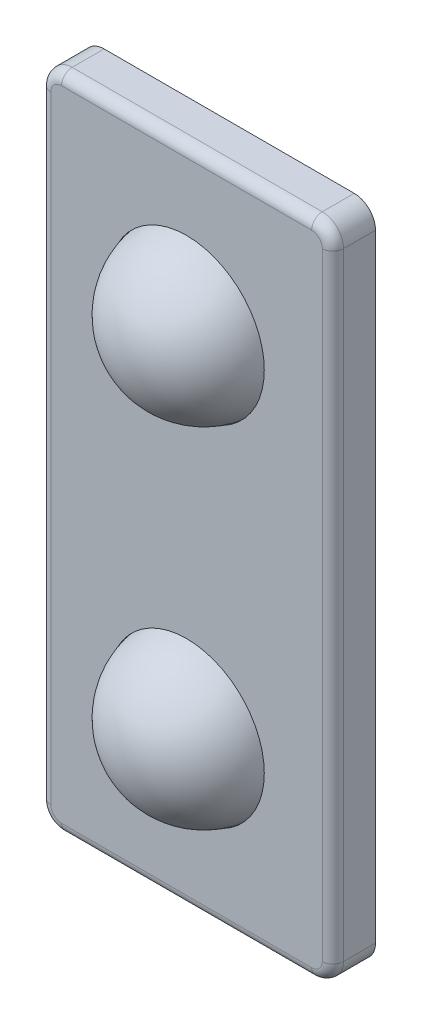
ISO-10303-21;
HEADER;
FILE_DESCRIPTION(('STEP AP214'),'2;1');
FILE_NAME('part.step','',(''),(''),'','','');
FILE_SCHEMA(('AUTOMOTIVE_DESIGN { 1 0 10303 214 1 1 1 1 }'));
ENDSEC;
DATA;
#1=APPLICATION_CONTEXT('core data for automotive mechanical design processes');
#2=APPLICATION_PROTOCOL_DEFINITION('international standard','automotive_design',2000,#1);
#3=PRODUCT_CONTEXT('',#1,'mechanical');
#4=PRODUCT('Part','Part','',(#3));
#5=PRODUCT_RELATED_PRODUCT_CATEGORY('part','',(#4));
#6=PRODUCT_DEFINITION_FORMATION('','',#4);
#7=PRODUCT_DEFINITION_CONTEXT('part definition',#1,'design');
#8=PRODUCT_DEFINITION('design','',#6,#7);
#9=PRODUCT_DEFINITION_SHAPE('','',#8);
#10=(LENGTH_UNIT() NAMED_UNIT(*) SI_UNIT(.MILLI.,.METRE.));
#11=(NAMED_UNIT(*) PLANE_ANGLE_UNIT() SI_UNIT($,.RADIAN.));
#12=(NAMED_UNIT(*) SI_UNIT($,.STERADIAN.) SOLID_ANGLE_UNIT());
#13=UNCERTAINTY_MEASURE_WITH_UNIT(LENGTH_MEASURE(1.E-05),#10,'distance_accuracy_value','');
#14=(GEOMETRIC_REPRESENTATION_CONTEXT(3) GLOBAL_UNCERTAINTY_ASSIGNED_CONTEXT((#13)) GLOBAL_UNIT_ASSIGNED_CONTEXT((#10,
#11,#12)) REPRESENTATION_CONTEXT('',''));
#15=CARTESIAN_POINT('',(0.,0.,0.));
#16=DIRECTION('',(0.,0.,1.));
#17=DIRECTION('',(1.,0.,0.));
#18=AXIS2_PLACEMENT_3D('',#15,#16,#17);
#19=CARTESIAN_POINT('',(5.125,13.75,0.5));
#20=DIRECTION('',(-1.,0.,0.));
#21=DIRECTION('',(0.,-1.,0.));
#22=AXIS2_PLACEMENT_3D('',#19,#20,#21);
#23=PLANE('',#22);
#24=DIRECTION('',(0.,1.,0.));
#25=VECTOR('',#24,1.);
#26=CARTESIAN_POINT('',(5.125,13.75,0.));
#27=LINE('',#26,#25);
#28=CARTESIAN_POINT('',(5.125,-13.75,0.));
#29=VERTEX_POINT('',#28);
#30=CARTESIAN_POINT('',(5.125,13.75,0.));
#31=VERTEX_POINT('',#30);
#32=EDGE_CURVE('E183',#29,#31,#27,.T.);
#33=ORIENTED_EDGE('',*,*,#32,.T.);
#34=DIRECTION('',(0.,0.,-1.));
#35=VECTOR('',#34,1.);
#36=CARTESIAN_POINT('',(5.125,13.75,0.5));
#37=LINE('',#36,#35);
#38=CARTESIAN_POINT('',(5.125,13.75,0.5));
#39=VERTEX_POINT('',#38);
#40=EDGE_CURVE('E159',#39,#31,#37,.T.);
#41=ORIENTED_EDGE('',*,*,#40,.F.);
#42=DIRECTION('',(0.,1.,0.));
#43=VECTOR('',#42,1.);
#44=CARTESIAN_POINT('',(5.125,13.75,0.5));
#45=LINE('',#44,#43);
#46=CARTESIAN_POINT('',(5.125,-13.75,0.5));
#47=VERTEX_POINT('',#46);
#48=EDGE_CURVE('E153',#47,#39,#45,.T.);
#49=ORIENTED_EDGE('',*,*,#48,.F.);
#50=DIRECTION('',(0.,0.,-1.));
#51=VECTOR('',#50,1.);
#52=CARTESIAN_POINT('',(5.125,-13.75,0.5));
#53=LINE('',#52,#51);
#54=EDGE_CURVE('E156',#47,#29,#53,.T.);
#55=ORIENTED_EDGE('',*,*,#54,.T.);
#56=EDGE_LOOP('',(#33,#41,#49,#55));
#57=FACE_BOUND('',#56,.T.);
#58=ADVANCED_FACE('F37',(#57),#23,.F.);
#59=CARTESIAN_POINT('',(-5.125,13.75,0.5));
#60=DIRECTION('',(0.,-1.,0.));
#61=DIRECTION('',(0.,0.,-1.));
#62=AXIS2_PLACEMENT_3D('',#59,#60,#61);
#63=PLANE('',#62);
#64=DIRECTION('',(-1.,0.,0.));
#65=VECTOR('',#64,1.);
#66=CARTESIAN_POINT('',(-5.125,13.75,0.));
#67=LINE('',#66,#65);
#68=CARTESIAN_POINT('',(-5.125,13.75,0.));
#69=VERTEX_POINT('',#68);
#70=EDGE_CURVE('E185',#31,#69,#67,.T.);
#71=ORIENTED_EDGE('',*,*,#70,.T.);
#72=DIRECTION('',(0.,0.,-1.));
#73=VECTOR('',#72,1.);
#74=CARTESIAN_POINT('',(-5.125,13.75,0.5));
#75=LINE('',#74,#73);
#76=CARTESIAN_POINT('',(-5.125,13.75,0.5));
#77=VERTEX_POINT('',#76);
#78=EDGE_CURVE('E192',#77,#69,#75,.T.);
#79=ORIENTED_EDGE('',*,*,#78,.F.);
#80=DIRECTION('',(-1.,0.,0.));
#81=VECTOR('',#80,1.);
#82=CARTESIAN_POINT('',(-5.125,13.75,0.5));
#83=LINE('',#82,#81);
#84=EDGE_CURVE('E163',#39,#77,#83,.T.);
#85=ORIENTED_EDGE('',*,*,#84,.F.);
#86=ORIENTED_EDGE('',*,*,#40,.T.);
#87=EDGE_LOOP('',(#71,#79,#85,#86));
#88=FACE_BOUND('',#87,.T.);
#89=ADVANCED_FACE('F297',(#88),#63,.F.);
#90=CARTESIAN_POINT('',(-5.125,13.75,0.5));
#91=DIRECTION('',(1.,0.,0.));
#92=DIRECTION('',(0.,1.,0.));
#93=AXIS2_PLACEMENT_3D('',#90,#91,#92);
#94=PLANE('',#93);
#95=DIRECTION('',(0.,-1.,0.));
#96=VECTOR('',#95,1.);
#97=CARTESIAN_POINT('',(-5.125,13.75,0.));
#98=LINE('',#97,#96);
#99=CARTESIAN_POINT('',(-5.125,-13.75,0.));
#100=VERTEX_POINT('',#99);
#101=EDGE_CURVE('E188',#69,#100,#98,.T.);
#102=ORIENTED_EDGE('',*,*,#101,.T.);
#103=DIRECTION('',(0.,0.,-1.));
#104=VECTOR('',#103,1.);
#105=CARTESIAN_POINT('',(-5.125,-13.75,0.5));
#106=LINE('',#105,#104);
#107=CARTESIAN_POINT('',(-5.125,-13.75,0.5));
#108=VERTEX_POINT('',#107);
#109=EDGE_CURVE('E173',#108,#100,#106,.T.);
#110=ORIENTED_EDGE('',*,*,#109,.F.);
#111=DIRECTION('',(0.,-1.,0.));
#112=VECTOR('',#111,1.);
#113=CARTESIAN_POINT('',(-5.125,13.75,0.5));
#114=LINE('',#113,#112);
#115=EDGE_CURVE('E178',#77,#108,#114,.T.);
#116=ORIENTED_EDGE('',*,*,#115,.F.);
#117=ORIENTED_EDGE('',*,*,#78,.T.);
#118=EDGE_LOOP('',(#102,#110,#116,#117));
#119=FACE_BOUND('',#118,.T.);
#120=ADVANCED_FACE('F300',(#119),#94,.F.);
#121=CARTESIAN_POINT('',(-5.125,-13.75,0.5));
#122=DIRECTION('',(0.,1.,0.));
#123=DIRECTION('',(0.,0.,1.));
#124=AXIS2_PLACEMENT_3D('',#121,#122,#123);
#125=PLANE('',#124);
#126=DIRECTION('',(1.,0.,0.));
#127=VECTOR('',#126,1.);
#128=CARTESIAN_POINT('',(-5.125,-13.75,0.));
#129=LINE('',#128,#127);
#130=EDGE_CURVE('E164',#100,#29,#129,.T.);
#131=ORIENTED_EDGE('',*,*,#130,.T.);
#132=ORIENTED_EDGE('',*,*,#54,.F.);
#133=DIRECTION('',(1.,0.,0.));
#134=VECTOR('',#133,1.);
#135=CARTESIAN_POINT('',(-5.125,-13.75,0.5));
#136=LINE('',#135,#134);
#137=EDGE_CURVE('E170',#108,#47,#136,.T.);
#138=ORIENTED_EDGE('',*,*,#137,.F.);
#139=ORIENTED_EDGE('',*,*,#109,.T.);
#140=EDGE_LOOP('',(#131,#132,#138,#139));
#141=FACE_BOUND('',#140,.T.);
#142=ADVANCED_FACE('F168',(#141),#125,.F.);
#143=CARTESIAN_POINT('',(0.,0.,0.));
#144=DIRECTION('',(0.,0.,1.));
#145=DIRECTION('',(1.,0.,0.));
#146=AXIS2_PLACEMENT_3D('',#143,#144,#145);
#147=PLANE('',#146);
#148=ORIENTED_EDGE('',*,*,#32,.F.);
#149=ORIENTED_EDGE('',*,*,#130,.F.);
#150=ORIENTED_EDGE('',*,*,#101,.F.);
#151=ORIENTED_EDGE('',*,*,#70,.F.);
#152=EDGE_LOOP('',(#148,#149,#150,#151));
#153=FACE_BOUND('',#152,.T.);
#154=ADVANCED_FACE('F302',(#153),#147,.F.);
#155=CARTESIAN_POINT('',(6.875,-15.5,2.5));
#156=DIRECTION('',(-1.,0.,0.));
#157=DIRECTION('',(0.,0.,1.));
#158=AXIS2_PLACEMENT_3D('',#155,#156,#157);
#159=PLANE('',#158);
#160=DIRECTION('',(0.,0.,-1.));
#161=VECTOR('',#160,1.);
#162=CARTESIAN_POINT('',(6.875,14.5,2.5));
#163=LINE('',#162,#161);
#164=CARTESIAN_POINT('',(6.875,14.5,0.5));
#165=VERTEX_POINT('',#164);
#166=CARTESIAN_POINT('',(6.875,14.5,2.));
#167=VERTEX_POINT('',#166);
#168=EDGE_CURVE('E210',#165,#167,#163,.F.);
#169=ORIENTED_EDGE('',*,*,#168,.T.);
#170=DIRECTION('',(0.,1.,0.));
#171=VECTOR('',#170,1.);
#172=CARTESIAN_POINT('',(6.875,-15.5,2.));
#173=LINE('',#172,#171);
#174=CARTESIAN_POINT('',(6.875,-14.5,2.));
#175=VERTEX_POINT('',#174);
#176=EDGE_CURVE('E11',#167,#175,#173,.F.);
#177=ORIENTED_EDGE('',*,*,#176,.T.);
#178=DIRECTION('',(0.,0.,-1.));
#179=VECTOR('',#178,1.);
#180=CARTESIAN_POINT('',(6.875,-14.5,2.5));
#181=LINE('',#180,#179);
#182=CARTESIAN_POINT('',(6.875,-14.5,0.5));
#183=VERTEX_POINT('',#182);
#184=EDGE_CURVE('E208',#175,#183,#181,.T.);
#185=ORIENTED_EDGE('',*,*,#184,.T.);
#186=DIRECTION('',(0.,1.,0.));
#187=VECTOR('',#186,1.);
#188=CARTESIAN_POINT('',(6.875,-15.5,0.5));
#189=LINE('',#188,#187);
#190=EDGE_CURVE('E274',#183,#165,#189,.T.);
#191=ORIENTED_EDGE('',*,*,#190,.T.);
#192=EDGE_LOOP('',(#169,#177,#185,#191));
#193=FACE_BOUND('',#192,.T.);
#194=ADVANCED_FACE('F304',(#193),#159,.F.);
#195=CARTESIAN_POINT('',(-6.875,15.5,2.5));
#196=DIRECTION('',(0.,-1.,0.));
#197=DIRECTION('',(0.,0.,-1.));
#198=AXIS2_PLACEMENT_3D('',#195,#196,#197);
#199=PLANE('',#198);
#200=DIRECTION('',(0.,0.,-1.));
#201=VECTOR('',#200,1.);
#202=CARTESIAN_POINT('',(-5.875,15.5,2.5));
#203=LINE('',#202,#201);
#204=CARTESIAN_POINT('',(-5.875,15.5,0.5));
#205=VERTEX_POINT('',#204);
#206=CARTESIAN_POINT('',(-5.875,15.5,2.));
#207=VERTEX_POINT('',#206);
#208=EDGE_CURVE('E196',#205,#207,#203,.F.);
#209=ORIENTED_EDGE('',*,*,#208,.T.);
#210=DIRECTION('',(-1.,0.,0.));
#211=VECTOR('',#210,1.);
#212=CARTESIAN_POINT('',(-6.875,15.5,2.));
#213=LINE('',#212,#211);
#214=CARTESIAN_POINT('',(5.875,15.5,2.));
#215=VERTEX_POINT('',#214);
#216=EDGE_CURVE('E61',#207,#215,#213,.F.);
#217=ORIENTED_EDGE('',*,*,#216,.T.);
#218=DIRECTION('',(0.,0.,-1.));
#219=VECTOR('',#218,1.);
#220=CARTESIAN_POINT('',(5.875,15.5,2.5));
#221=LINE('',#220,#219);
#222=CARTESIAN_POINT('',(5.875,15.5,0.5));
#223=VERTEX_POINT('',#222);
#224=EDGE_CURVE('E198',#215,#223,#221,.T.);
#225=ORIENTED_EDGE('',*,*,#224,.T.);
#226=DIRECTION('',(-1.,0.,0.));
#227=VECTOR('',#226,1.);
#228=CARTESIAN_POINT('',(-6.875,15.5,0.5));
#229=LINE('',#228,#227);
#230=EDGE_CURVE('E289',#223,#205,#229,.T.);
#231=ORIENTED_EDGE('',*,*,#230,.T.);
#232=EDGE_LOOP('',(#209,#217,#225,#231));
#233=FACE_BOUND('',#232,.T.);
#234=ADVANCED_FACE('F310',(#233),#199,.F.);
#235=CARTESIAN_POINT('',(-6.875,-15.5,2.5));
#236=DIRECTION('',(1.,0.,0.));
#237=DIRECTION('',(0.,0.,-1.));
#238=AXIS2_PLACEMENT_3D('',#235,#236,#237);
#239=PLANE('',#238);
#240=DIRECTION('',(0.,0.,-1.));
#241=VECTOR('',#240,1.);
#242=CARTESIAN_POINT('',(-6.875,-14.5,2.5));
#243=LINE('',#242,#241);
#244=CARTESIAN_POINT('',(-6.875,-14.5,0.5));
#245=VERTEX_POINT('',#244);
#246=CARTESIAN_POINT('',(-6.875,-14.5,2.));
#247=VERTEX_POINT('',#246);
#248=EDGE_CURVE('E219',#245,#247,#243,.F.);
#249=ORIENTED_EDGE('',*,*,#248,.T.);
#250=DIRECTION('',(0.,-1.,0.));
#251=VECTOR('',#250,1.);
#252=CARTESIAN_POINT('',(-6.875,-15.5,2.));
#253=LINE('',#252,#251);
#254=CARTESIAN_POINT('',(-6.875,14.5,2.));
#255=VERTEX_POINT('',#254);
#256=EDGE_CURVE('E246',#247,#255,#253,.F.);
#257=ORIENTED_EDGE('',*,*,#256,.T.);
#258=DIRECTION('',(0.,0.,-1.));
#259=VECTOR('',#258,1.);
#260=CARTESIAN_POINT('',(-6.875,14.5,2.5));
#261=LINE('',#260,#259);
#262=CARTESIAN_POINT('',(-6.875,14.5,0.5));
#263=VERTEX_POINT('',#262);
#264=EDGE_CURVE('E217',#255,#263,#261,.T.);
#265=ORIENTED_EDGE('',*,*,#264,.T.);
#266=DIRECTION('',(0.,-1.,0.));
#267=VECTOR('',#266,1.);
#268=CARTESIAN_POINT('',(-6.875,-15.5,0.5));
#269=LINE('',#268,#267);
#270=EDGE_CURVE('E292',#263,#245,#269,.T.);
#271=ORIENTED_EDGE('',*,*,#270,.T.);
#272=EDGE_LOOP('',(#249,#257,#265,#271));
#273=FACE_BOUND('',#272,.T.);
#274=ADVANCED_FACE('F394',(#273),#239,.F.);
#275=CARTESIAN_POINT('',(-6.875,-15.5,2.5));
#276=DIRECTION('',(0.,1.,0.));
#277=DIRECTION('',(0.,0.,1.));
#278=AXIS2_PLACEMENT_3D('',#275,#276,#277);
#279=PLANE('',#278);
#280=DIRECTION('',(0.,0.,-1.));
#281=VECTOR('',#280,1.);
#282=CARTESIAN_POINT('',(5.875,-15.5,2.5));
#283=LINE('',#282,#281);
#284=CARTESIAN_POINT('',(5.875,-15.5,0.5));
#285=VERTEX_POINT('',#284);
#286=CARTESIAN_POINT('',(5.875,-15.5,2.));
#287=VERTEX_POINT('',#286);
#288=EDGE_CURVE('E214',#285,#287,#283,.F.);
#289=ORIENTED_EDGE('',*,*,#288,.T.);
#290=DIRECTION('',(1.,0.,0.));
#291=VECTOR('',#290,1.);
#292=CARTESIAN_POINT('',(-6.875,-15.5,2.));
#293=LINE('',#292,#291);
#294=CARTESIAN_POINT('',(-5.875,-15.5,2.));
#295=VERTEX_POINT('',#294);
#296=EDGE_CURVE('E242',#287,#295,#293,.F.);
#297=ORIENTED_EDGE('',*,*,#296,.T.);
#298=DIRECTION('',(0.,0.,-1.));
#299=VECTOR('',#298,1.);
#300=CARTESIAN_POINT('',(-5.875,-15.5,2.5));
#301=LINE('',#300,#299);
#302=CARTESIAN_POINT('',(-5.875,-15.5,0.5));
#303=VERTEX_POINT('',#302);
#304=EDGE_CURVE('E212',#295,#303,#301,.T.);
#305=ORIENTED_EDGE('',*,*,#304,.T.);
#306=DIRECTION('',(1.,0.,0.));
#307=VECTOR('',#306,1.);
#308=CARTESIAN_POINT('',(-6.875,-15.5,0.5));
#309=LINE('',#308,#307);
#310=EDGE_CURVE('E186',#303,#285,#309,.T.);
#311=ORIENTED_EDGE('',*,*,#310,.T.);
#312=EDGE_LOOP('',(#289,#297,#305,#311));
#313=FACE_BOUND('',#312,.T.);
#314=ADVANCED_FACE('F388',(#313),#279,.F.);
#315=CARTESIAN_POINT('',(0.,0.,2.5));
#316=DIRECTION('',(0.,0.,-1.));
#317=DIRECTION('',(-1.,0.,0.));
#318=AXIS2_PLACEMENT_3D('',#315,#316,#317);
#319=PLANE('',#318);
#320=CARTESIAN_POINT('',(0.,-8.2,2.5));
#321=DIRECTION('',(0.,0.,-1.));
#322=DIRECTION('',(1.,0.,0.));
#323=AXIS2_PLACEMENT_3D('',#320,#321,#322);
#324=CIRCLE('',#323,3.65);
#325=CARTESIAN_POINT('',(3.65,-8.2,2.5));
#326=VERTEX_POINT('',#325);
#327=EDGE_CURVE('E284',#326,#326,#324,.T.);
#328=ORIENTED_EDGE('',*,*,#327,.T.);
#329=EDGE_LOOP('',(#328));
#330=FACE_BOUND('',#329,.T.);
#331=CARTESIAN_POINT('',(0.,8.2,2.5));
#332=DIRECTION('',(0.,0.,1.));
#333=DIRECTION('',(1.,0.,0.));
#334=AXIS2_PLACEMENT_3D('',#331,#332,#333);
#335=CIRCLE('',#334,3.65);
#336=CARTESIAN_POINT('',(3.65,8.2,2.5));
#337=VERTEX_POINT('',#336);
#338=EDGE_CURVE('E276',#337,#337,#335,.T.);
#339=ORIENTED_EDGE('',*,*,#338,.F.);
#340=EDGE_LOOP('',(#339));
#341=FACE_BOUND('',#340,.T.);
#342=DIRECTION('',(1.,0.,0.));
#343=VECTOR('',#342,1.);
#344=CARTESIAN_POINT('',(0.,-15.,2.5));
#345=LINE('',#344,#343);
#346=CARTESIAN_POINT('',(-5.875,-15.,2.5));
#347=VERTEX_POINT('',#346);
#348=CARTESIAN_POINT('',(5.875,-15.,2.5));
#349=VERTEX_POINT('',#348);
#350=EDGE_CURVE('E234',#347,#349,#345,.T.);
#351=ORIENTED_EDGE('',*,*,#350,.T.);
#352=CARTESIAN_POINT('',(5.875,-14.5,2.5));
#353=DIRECTION('',(0.,0.,-1.));
#354=DIRECTION('',(-1.,0.,0.));
#355=AXIS2_PLACEMENT_3D('',#352,#353,#354);
#356=CIRCLE('',#355,0.5);
#357=CARTESIAN_POINT('',(6.375,-14.5,2.5));
#358=VERTEX_POINT('',#357);
#359=EDGE_CURVE('E236',#349,#358,#356,.F.);
#360=ORIENTED_EDGE('',*,*,#359,.T.);
#361=DIRECTION('',(0.,1.,0.));
#362=VECTOR('',#361,1.);
#363=CARTESIAN_POINT('',(6.375,0.,2.5));
#364=LINE('',#363,#362);
#365=CARTESIAN_POINT('',(6.375,14.5,2.5));
#366=VERTEX_POINT('',#365);
#367=EDGE_CURVE('E222',#358,#366,#364,.T.);
#368=ORIENTED_EDGE('',*,*,#367,.T.);
#369=CARTESIAN_POINT('',(5.875,14.5,2.5));
#370=DIRECTION('',(0.,0.,-1.));
#371=DIRECTION('',(-1.,0.,0.));
#372=AXIS2_PLACEMENT_3D('',#369,#370,#371);
#373=CIRCLE('',#372,0.5);
#374=CARTESIAN_POINT('',(5.875,15.,2.5));
#375=VERTEX_POINT('',#374);
#376=EDGE_CURVE('E224',#366,#375,#373,.F.);
#377=ORIENTED_EDGE('',*,*,#376,.T.);
#378=DIRECTION('',(-1.,0.,0.));
#379=VECTOR('',#378,1.);
#380=CARTESIAN_POINT('',(0.,15.,2.5));
#381=LINE('',#380,#379);
#382=CARTESIAN_POINT('',(-5.875,15.,2.5));
#383=VERTEX_POINT('',#382);
#384=EDGE_CURVE('E226',#375,#383,#381,.T.);
#385=ORIENTED_EDGE('',*,*,#384,.T.);
#386=CARTESIAN_POINT('',(-5.875,14.5,2.5));
#387=DIRECTION('',(0.,0.,-1.));
#388=DIRECTION('',(-1.,0.,0.));
#389=AXIS2_PLACEMENT_3D('',#386,#387,#388);
#390=CIRCLE('',#389,0.5);
#391=CARTESIAN_POINT('',(-6.375,14.5,2.5));
#392=VERTEX_POINT('',#391);
#393=EDGE_CURVE('E228',#383,#392,#390,.F.);
#394=ORIENTED_EDGE('',*,*,#393,.T.);
#395=DIRECTION('',(0.,-1.,0.));
#396=VECTOR('',#395,1.);
#397=CARTESIAN_POINT('',(-6.375,0.,2.5));
#398=LINE('',#397,#396);
#399=CARTESIAN_POINT('',(-6.375,-14.5,2.5));
#400=VERTEX_POINT('',#399);
#401=EDGE_CURVE('E230',#392,#400,#398,.T.);
#402=ORIENTED_EDGE('',*,*,#401,.T.);
#403=CARTESIAN_POINT('',(-5.875,-14.5,2.5));
#404=DIRECTION('',(0.,0.,-1.));
#405=DIRECTION('',(-1.,0.,0.));
#406=AXIS2_PLACEMENT_3D('',#403,#404,#405);
#407=CIRCLE('',#406,0.5);
#408=EDGE_CURVE('E232',#400,#347,#407,.F.);
#409=ORIENTED_EDGE('',*,*,#408,.T.);
#410=EDGE_LOOP('',(#351,#360,#368,#377,#385,#394,#402,#409));
#411=FACE_BOUND('',#410,.T.);
#412=ADVANCED_FACE('F385',(#330,#341,#411),#319,.F.);
#413=CARTESIAN_POINT('',(0.,0.,0.5));
#414=DIRECTION('',(0.,0.,-1.));
#415=DIRECTION('',(-1.,0.,0.));
#416=AXIS2_PLACEMENT_3D('',#413,#414,#415);
#417=PLANE('',#416);
#418=ORIENTED_EDGE('',*,*,#137,.T.);
#419=ORIENTED_EDGE('',*,*,#48,.T.);
#420=ORIENTED_EDGE('',*,*,#84,.T.);
#421=ORIENTED_EDGE('',*,*,#115,.T.);
#422=EDGE_LOOP('',(#418,#419,#420,#421));
#423=FACE_BOUND('',#422,.T.);
#424=ORIENTED_EDGE('',*,*,#230,.F.);
#425=CARTESIAN_POINT('',(5.875,14.5,0.5));
#426=DIRECTION('',(0.,0.,-1.));
#427=DIRECTION('',(-1.,0.,0.));
#428=AXIS2_PLACEMENT_3D('',#425,#426,#427);
#429=CIRCLE('',#428,1.);
#430=EDGE_CURVE('E206',#223,#165,#429,.T.);
#431=ORIENTED_EDGE('',*,*,#430,.T.);
#432=ORIENTED_EDGE('',*,*,#190,.F.);
#433=CARTESIAN_POINT('',(5.875,-14.5,0.5));
#434=DIRECTION('',(0.,0.,-1.));
#435=DIRECTION('',(-1.,0.,0.));
#436=AXIS2_PLACEMENT_3D('',#433,#434,#435);
#437=CIRCLE('',#436,1.);
#438=EDGE_CURVE('E204',#183,#285,#437,.T.);
#439=ORIENTED_EDGE('',*,*,#438,.T.);
#440=ORIENTED_EDGE('',*,*,#310,.F.);
#441=CARTESIAN_POINT('',(-5.875,-14.5,0.5));
#442=DIRECTION('',(0.,0.,-1.));
#443=DIRECTION('',(-1.,0.,0.));
#444=AXIS2_PLACEMENT_3D('',#441,#442,#443);
#445=CIRCLE('',#444,1.);
#446=EDGE_CURVE('E202',#303,#245,#445,.T.);
#447=ORIENTED_EDGE('',*,*,#446,.T.);
#448=ORIENTED_EDGE('',*,*,#270,.F.);
#449=CARTESIAN_POINT('',(-5.875,14.5,0.5));
#450=DIRECTION('',(0.,0.,-1.));
#451=DIRECTION('',(-1.,0.,0.));
#452=AXIS2_PLACEMENT_3D('',#449,#450,#451);
#453=CIRCLE('',#452,1.);
#454=EDGE_CURVE('E200',#263,#205,#453,.T.);
#455=ORIENTED_EDGE('',*,*,#454,.T.);
#456=EDGE_LOOP('',(#424,#431,#432,#439,#440,#447,#448,#455));
#457=FACE_BOUND('',#456,.T.);
#458=ADVANCED_FACE('F175',(#423,#457),#417,.T.);
#459=CARTESIAN_POINT('',(5.875,14.5,2.5));
#460=DIRECTION('',(0.,0.,-1.));
#461=DIRECTION('',(-1.,0.,0.));
#462=AXIS2_PLACEMENT_3D('',#459,#460,#461);
#463=CYLINDRICAL_SURFACE('',#462,1.);
#464=ORIENTED_EDGE('',*,*,#224,.F.);
#465=CARTESIAN_POINT('',(5.875,14.5,2.));
#466=DIRECTION('',(0.,0.,-1.));
#467=DIRECTION('',(-1.,0.,0.));
#468=AXIS2_PLACEMENT_3D('',#465,#466,#467);
#469=CIRCLE('',#468,1.);
#470=EDGE_CURVE('E46',#215,#167,#469,.T.);
#471=ORIENTED_EDGE('',*,*,#470,.T.);
#472=ORIENTED_EDGE('',*,*,#168,.F.);
#473=ORIENTED_EDGE('',*,*,#430,.F.);
#474=EDGE_LOOP('',(#464,#471,#472,#473));
#475=FACE_BOUND('',#474,.T.);
#476=ADVANCED_FACE('F322',(#475),#463,.T.);
#477=CARTESIAN_POINT('',(5.875,-14.5,2.5));
#478=DIRECTION('',(0.,0.,-1.));
#479=DIRECTION('',(-1.,0.,0.));
#480=AXIS2_PLACEMENT_3D('',#477,#478,#479);
#481=CYLINDRICAL_SURFACE('',#480,1.);
#482=ORIENTED_EDGE('',*,*,#184,.F.);
#483=CARTESIAN_POINT('',(5.875,-14.5,2.));
#484=DIRECTION('',(0.,0.,-1.));
#485=DIRECTION('',(-1.,0.,0.));
#486=AXIS2_PLACEMENT_3D('',#483,#484,#485);
#487=CIRCLE('',#486,1.);
#488=EDGE_CURVE('E239',#175,#287,#487,.T.);
#489=ORIENTED_EDGE('',*,*,#488,.T.);
#490=ORIENTED_EDGE('',*,*,#288,.F.);
#491=ORIENTED_EDGE('',*,*,#438,.F.);
#492=EDGE_LOOP('',(#482,#489,#490,#491));
#493=FACE_BOUND('',#492,.T.);
#494=ADVANCED_FACE('F325',(#493),#481,.T.);
#495=CARTESIAN_POINT('',(-5.875,-14.5,2.5));
#496=DIRECTION('',(0.,0.,-1.));
#497=DIRECTION('',(-1.,0.,0.));
#498=AXIS2_PLACEMENT_3D('',#495,#496,#497);
#499=CYLINDRICAL_SURFACE('',#498,1.);
#500=ORIENTED_EDGE('',*,*,#304,.F.);
#501=CARTESIAN_POINT('',(-5.875,-14.5,2.));
#502=DIRECTION('',(0.,0.,-1.));
#503=DIRECTION('',(-1.,0.,0.));
#504=AXIS2_PLACEMENT_3D('',#501,#502,#503);
#505=CIRCLE('',#504,1.);
#506=EDGE_CURVE('E244',#295,#247,#505,.T.);
#507=ORIENTED_EDGE('',*,*,#506,.T.);
#508=ORIENTED_EDGE('',*,*,#248,.F.);
#509=ORIENTED_EDGE('',*,*,#446,.F.);
#510=EDGE_LOOP('',(#500,#507,#508,#509));
#511=FACE_BOUND('',#510,.T.);
#512=ADVANCED_FACE('F328',(#511),#499,.T.);
#513=CARTESIAN_POINT('',(-5.875,14.5,2.5));
#514=DIRECTION('',(0.,0.,-1.));
#515=DIRECTION('',(-1.,0.,0.));
#516=AXIS2_PLACEMENT_3D('',#513,#514,#515);
#517=CYLINDRICAL_SURFACE('',#516,1.);
#518=ORIENTED_EDGE('',*,*,#264,.F.);
#519=CARTESIAN_POINT('',(-5.875,14.5,2.));
#520=DIRECTION('',(0.,0.,-1.));
#521=DIRECTION('',(-1.,0.,0.));
#522=AXIS2_PLACEMENT_3D('',#519,#520,#521);
#523=CIRCLE('',#522,1.);
#524=EDGE_CURVE('E248',#255,#207,#523,.T.);
#525=ORIENTED_EDGE('',*,*,#524,.T.);
#526=ORIENTED_EDGE('',*,*,#208,.F.);
#527=ORIENTED_EDGE('',*,*,#454,.F.);
#528=EDGE_LOOP('',(#518,#525,#526,#527));
#529=FACE_BOUND('',#528,.T.);
#530=ADVANCED_FACE('F332',(#529),#517,.T.);
#531=CARTESIAN_POINT('',(-5.875,14.5,2.));
#532=DIRECTION('',(0.,0.,-1.));
#533=DIRECTION('',(-1.,0.,0.));
#534=AXIS2_PLACEMENT_3D('',#531,#532,#533);
#535=DEGENERATE_TOROIDAL_SURFACE('',#534,0.5,0.5,.T.);
#536=CARTESIAN_POINT('',(-5.875,15.,2.));
#537=DIRECTION('',(1.,0.,0.));
#538=DIRECTION('',(0.,0.,-1.));
#539=AXIS2_PLACEMENT_3D('',#536,#537,#538);
#540=CIRCLE('',#539,0.5);
#541=EDGE_CURVE('E269',#207,#383,#540,.T.);
#542=ORIENTED_EDGE('',*,*,#541,.F.);
#543=ORIENTED_EDGE('',*,*,#524,.F.);
#544=CARTESIAN_POINT('',(-6.375,14.5,2.));
#545=DIRECTION('',(0.,-1.,0.));
#546=DIRECTION('',(0.,0.,-1.));
#547=AXIS2_PLACEMENT_3D('',#544,#545,#546);
#548=CIRCLE('',#547,0.5);
#549=EDGE_CURVE('E272',#392,#255,#548,.T.);
#550=ORIENTED_EDGE('',*,*,#549,.F.);
#551=ORIENTED_EDGE('',*,*,#393,.F.);
#552=EDGE_LOOP('',(#542,#543,#550,#551));
#553=FACE_BOUND('',#552,.T.);
#554=ADVANCED_FACE('F336',(#553),#535,.T.);
#555=CARTESIAN_POINT('',(-6.375,0.,2.));
#556=DIRECTION('',(0.,-1.,0.));
#557=DIRECTION('',(0.,0.,-1.));
#558=AXIS2_PLACEMENT_3D('',#555,#556,#557);
#559=CYLINDRICAL_SURFACE('',#558,0.5);
#560=ORIENTED_EDGE('',*,*,#549,.T.);
#561=ORIENTED_EDGE('',*,*,#256,.F.);
#562=CARTESIAN_POINT('',(-6.375,-14.5,2.));
#563=DIRECTION('',(0.,-1.,0.));
#564=DIRECTION('',(0.,0.,-1.));
#565=AXIS2_PLACEMENT_3D('',#562,#563,#564);
#566=CIRCLE('',#565,0.5);
#567=EDGE_CURVE('E266',#400,#247,#566,.T.);
#568=ORIENTED_EDGE('',*,*,#567,.F.);
#569=ORIENTED_EDGE('',*,*,#401,.F.);
#570=EDGE_LOOP('',(#560,#561,#568,#569));
#571=FACE_BOUND('',#570,.T.);
#572=ADVANCED_FACE('F362',(#571),#559,.T.);
#573=CARTESIAN_POINT('',(0.,15.,2.));
#574=DIRECTION('',(-1.,0.,0.));
#575=DIRECTION('',(0.,0.,1.));
#576=AXIS2_PLACEMENT_3D('',#573,#574,#575);
#577=CYLINDRICAL_SURFACE('',#576,0.5);
#578=ORIENTED_EDGE('',*,*,#541,.T.);
#579=ORIENTED_EDGE('',*,*,#384,.F.);
#580=CARTESIAN_POINT('',(5.875,15.,2.));
#581=DIRECTION('',(1.,0.,0.));
#582=DIRECTION('',(0.,0.,-1.));
#583=AXIS2_PLACEMENT_3D('',#580,#581,#582);
#584=CIRCLE('',#583,0.5);
#585=EDGE_CURVE('E263',#215,#375,#584,.T.);
#586=ORIENTED_EDGE('',*,*,#585,.F.);
#587=ORIENTED_EDGE('',*,*,#216,.F.);
#588=EDGE_LOOP('',(#578,#579,#586,#587));
#589=FACE_BOUND('',#588,.T.);
#590=ADVANCED_FACE('F358',(#589),#577,.T.);
#591=CARTESIAN_POINT('',(-5.875,-14.5,2.));
#592=DIRECTION('',(0.,0.,-1.));
#593=DIRECTION('',(-1.,0.,0.));
#594=AXIS2_PLACEMENT_3D('',#591,#592,#593);
#595=DEGENERATE_TOROIDAL_SURFACE('',#594,0.5,0.5,.T.);
#596=ORIENTED_EDGE('',*,*,#567,.T.);
#597=ORIENTED_EDGE('',*,*,#506,.F.);
#598=CARTESIAN_POINT('',(-5.875,-15.,2.));
#599=DIRECTION('',(1.,0.,0.));
#600=DIRECTION('',(0.,0.,-1.));
#601=AXIS2_PLACEMENT_3D('',#598,#599,#600);
#602=CIRCLE('',#601,0.5);
#603=EDGE_CURVE('E260',#347,#295,#602,.T.);
#604=ORIENTED_EDGE('',*,*,#603,.F.);
#605=ORIENTED_EDGE('',*,*,#408,.F.);
#606=EDGE_LOOP('',(#596,#597,#604,#605));
#607=FACE_BOUND('',#606,.T.);
#608=ADVANCED_FACE('F354',(#607),#595,.T.);
#609=CARTESIAN_POINT('',(5.875,14.5,2.));
#610=DIRECTION('',(0.,0.,-1.));
#611=DIRECTION('',(-1.,0.,0.));
#612=AXIS2_PLACEMENT_3D('',#609,#610,#611);
#613=DEGENERATE_TOROIDAL_SURFACE('',#612,0.5,0.5,.T.);
#614=ORIENTED_EDGE('',*,*,#585,.T.);
#615=ORIENTED_EDGE('',*,*,#376,.F.);
#616=CARTESIAN_POINT('',(6.375,14.5,2.));
#617=DIRECTION('',(0.,-1.,0.));
#618=DIRECTION('',(0.,0.,-1.));
#619=AXIS2_PLACEMENT_3D('',#616,#617,#618);
#620=CIRCLE('',#619,0.5);
#621=EDGE_CURVE('E257',#167,#366,#620,.T.);
#622=ORIENTED_EDGE('',*,*,#621,.F.);
#623=ORIENTED_EDGE('',*,*,#470,.F.);
#624=EDGE_LOOP('',(#614,#615,#622,#623));
#625=FACE_BOUND('',#624,.T.);
#626=ADVANCED_FACE('F350',(#625),#613,.T.);
#627=CARTESIAN_POINT('',(0.,-15.,2.));
#628=DIRECTION('',(1.,0.,0.));
#629=DIRECTION('',(0.,0.,-1.));
#630=AXIS2_PLACEMENT_3D('',#627,#628,#629);
#631=CYLINDRICAL_SURFACE('',#630,0.5);
#632=ORIENTED_EDGE('',*,*,#603,.T.);
#633=ORIENTED_EDGE('',*,*,#296,.F.);
#634=CARTESIAN_POINT('',(5.875,-15.,2.));
#635=DIRECTION('',(1.,0.,0.));
#636=DIRECTION('',(0.,0.,-1.));
#637=AXIS2_PLACEMENT_3D('',#634,#635,#636);
#638=CIRCLE('',#637,0.5);
#639=EDGE_CURVE('E254',#349,#287,#638,.T.);
#640=ORIENTED_EDGE('',*,*,#639,.F.);
#641=ORIENTED_EDGE('',*,*,#350,.F.);
#642=EDGE_LOOP('',(#632,#633,#640,#641));
#643=FACE_BOUND('',#642,.T.);
#644=ADVANCED_FACE('F346',(#643),#631,.T.);
#645=CARTESIAN_POINT('',(6.375,0.,2.));
#646=DIRECTION('',(0.,1.,0.));
#647=DIRECTION('',(0.,0.,1.));
#648=AXIS2_PLACEMENT_3D('',#645,#646,#647);
#649=CYLINDRICAL_SURFACE('',#648,0.5);
#650=ORIENTED_EDGE('',*,*,#621,.T.);
#651=ORIENTED_EDGE('',*,*,#367,.F.);
#652=CARTESIAN_POINT('',(6.375,-14.5,2.));
#653=DIRECTION('',(0.,-1.,0.));
#654=DIRECTION('',(0.,0.,-1.));
#655=AXIS2_PLACEMENT_3D('',#652,#653,#654);
#656=CIRCLE('',#655,0.5);
#657=EDGE_CURVE('E252',#175,#358,#656,.T.);
#658=ORIENTED_EDGE('',*,*,#657,.F.);
#659=ORIENTED_EDGE('',*,*,#176,.F.);
#660=EDGE_LOOP('',(#650,#651,#658,#659));
#661=FACE_BOUND('',#660,.T.);
#662=ADVANCED_FACE('F342',(#661),#649,.T.);
#663=CARTESIAN_POINT('',(5.875,-14.5,2.));
#664=DIRECTION('',(0.,0.,-1.));
#665=DIRECTION('',(-1.,0.,0.));
#666=AXIS2_PLACEMENT_3D('',#663,#664,#665);
#667=DEGENERATE_TOROIDAL_SURFACE('',#666,0.5,0.5,.T.);
#668=ORIENTED_EDGE('',*,*,#639,.T.);
#669=ORIENTED_EDGE('',*,*,#488,.F.);
#670=ORIENTED_EDGE('',*,*,#657,.T.);
#671=ORIENTED_EDGE('',*,*,#359,.F.);
#672=EDGE_LOOP('',(#668,#669,#670,#671));
#673=FACE_BOUND('',#672,.T.);
#674=ADVANCED_FACE('F338',(#673),#667,.T.);
#675=CARTESIAN_POINT('',(0.,8.2,2.4));
#676=DIRECTION('',(0.,0.,1.));
#677=DIRECTION('',(1.,0.,0.));
#678=AXIS2_PLACEMENT_3D('',#675,#676,#677);
#679=CYLINDRICAL_SURFACE('',#678,3.65);
#680=CARTESIAN_POINT('',(0.,8.2,2.4));
#681=DIRECTION('',(0.,0.,1.));
#682=DIRECTION('',(1.,0.,0.));
#683=AXIS2_PLACEMENT_3D('',#680,#681,#682);
#684=CIRCLE('',#683,3.65);
#685=CARTESIAN_POINT('',(3.65,8.2,2.4));
#686=VERTEX_POINT('',#685);
#687=EDGE_CURVE('E255',#686,#686,#684,.T.);
#688=ORIENTED_EDGE('',*,*,#687,.F.);
#689=EDGE_LOOP('',(#688));
#690=FACE_BOUND('',#689,.T.);
#691=ORIENTED_EDGE('',*,*,#338,.T.);
#692=EDGE_LOOP('',(#691));
#693=FACE_BOUND('',#692,.T.);
#694=ADVANCED_FACE('F341',(#690,#693),#679,.F.);
#695=CARTESIAN_POINT('',(0.,8.2,1.67958333333333));
#696=DIRECTION('',(0.,0.,1.));
#697=DIRECTION('',(1.,0.,0.));
#698=AXIS2_PLACEMENT_3D('',#695,#696,#697);
#699=SPHERICAL_SURFACE('',#698,3.72041666666667);
#700=ORIENTED_EDGE('',*,*,#687,.T.);
#701=EDGE_LOOP('',(#700));
#702=FACE_BOUND('',#701,.T.);
#703=ADVANCED_FACE('F369',(#702),#699,.T.);
#704=CARTESIAN_POINT('',(0.,-8.2,2.4));
#705=DIRECTION('',(0.,0.,1.));
#706=DIRECTION('',(1.,0.,0.));
#707=AXIS2_PLACEMENT_3D('',#704,#705,#706);
#708=CYLINDRICAL_SURFACE('',#707,3.65);
#709=CARTESIAN_POINT('',(0.,-8.2,2.4));
#710=DIRECTION('',(0.,0.,-1.));
#711=DIRECTION('',(1.,0.,0.));
#712=AXIS2_PLACEMENT_3D('',#709,#710,#711);
#713=CIRCLE('',#712,3.65);
#714=CARTESIAN_POINT('',(3.65,-8.2,2.4));
#715=VERTEX_POINT('',#714);
#716=EDGE_CURVE('E41',#715,#715,#713,.T.);
#717=ORIENTED_EDGE('',*,*,#716,.T.);
#718=EDGE_LOOP('',(#717));
#719=FACE_BOUND('',#718,.T.);
#720=ORIENTED_EDGE('',*,*,#327,.F.);
#721=EDGE_LOOP('',(#720));
#722=FACE_BOUND('',#721,.T.);
#723=ADVANCED_FACE('F371',(#719,#722),#708,.F.);
#724=CARTESIAN_POINT('',(0.,-8.2,1.67958333333333));
#725=DIRECTION('',(0.,0.,1.));
#726=DIRECTION('',(1.,0.,0.));
#727=AXIS2_PLACEMENT_3D('',#724,#725,#726);
#728=SPHERICAL_SURFACE('',#727,3.72041666666667);
#729=ORIENTED_EDGE('',*,*,#716,.F.);
#730=EDGE_LOOP('',(#729));
#731=FACE_BOUND('',#730,.T.);
#732=ADVANCED_FACE('F39',(#731),#728,.T.);
#733=CLOSED_SHELL('',(#58,#89,#120,#142,#154,#194,#234,#274,#314,#412,#458,#476,#494,#512,#530,
#554,#572,#590,#608,#626,#644,#662,#674,#694,#703,#723,#732));
#734=MANIFOLD_SOLID_BREP('B2',#733);
#735=ADVANCED_BREP_SHAPE_REPRESENTATION('',(#18,#734),#14);
#736=SHAPE_DEFINITION_REPRESENTATION(#9,#735);
ENDSEC;
END-ISO-10303-21;
